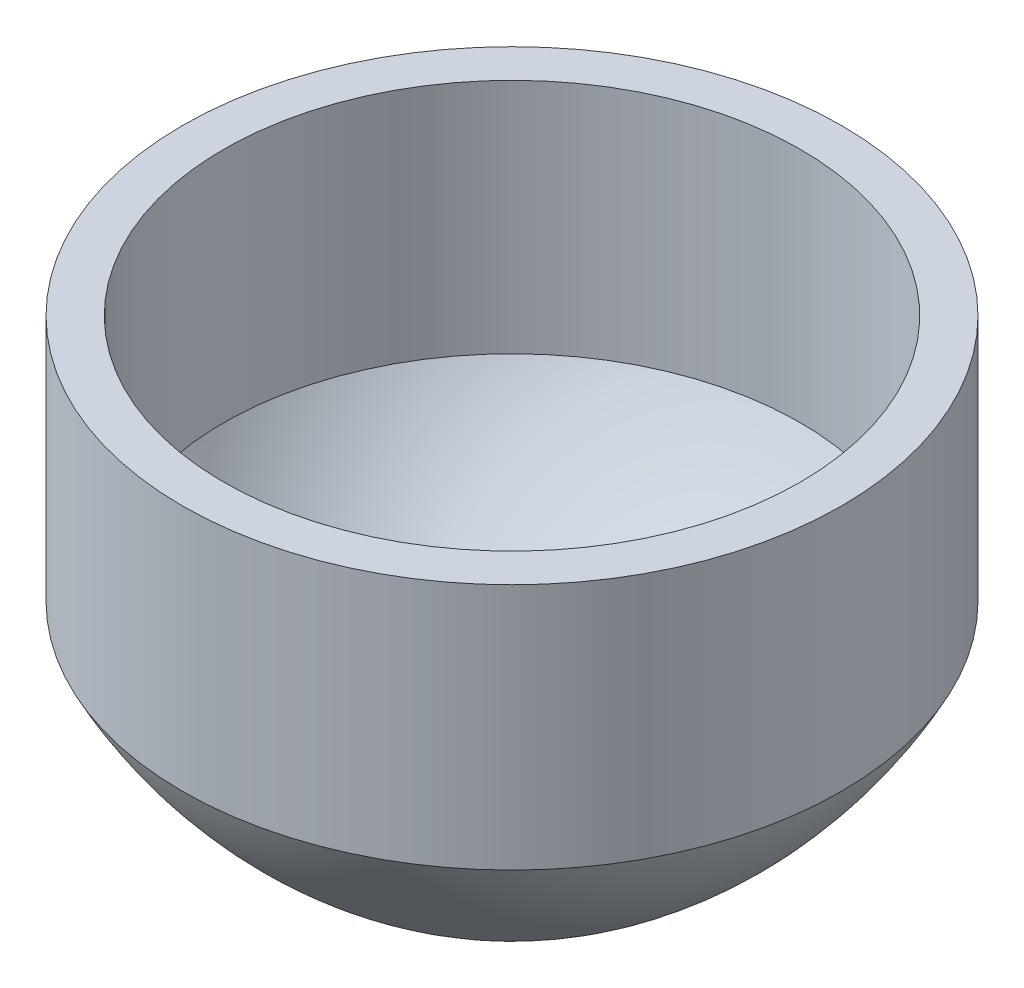
ISO-10303-21;
HEADER;
FILE_DESCRIPTION(('STEP AP214'),'2;1');
FILE_NAME('part.step','',(''),(''),'','','');
FILE_SCHEMA(('AUTOMOTIVE_DESIGN { 1 0 10303 214 1 1 1 1 }'));
ENDSEC;
DATA;
#1=APPLICATION_CONTEXT('core data for automotive mechanical design processes');
#2=APPLICATION_PROTOCOL_DEFINITION('international standard','automotive_design',2000,#1);
#3=PRODUCT_CONTEXT('',#1,'mechanical');
#4=PRODUCT('Part','Part','',(#3));
#5=PRODUCT_RELATED_PRODUCT_CATEGORY('part','',(#4));
#6=PRODUCT_DEFINITION_FORMATION('','',#4);
#7=PRODUCT_DEFINITION_CONTEXT('part definition',#1,'design');
#8=PRODUCT_DEFINITION('design','',#6,#7);
#9=PRODUCT_DEFINITION_SHAPE('','',#8);
#10=(LENGTH_UNIT() NAMED_UNIT(*) SI_UNIT(.MILLI.,.METRE.));
#11=(NAMED_UNIT(*) PLANE_ANGLE_UNIT() SI_UNIT($,.RADIAN.));
#12=(NAMED_UNIT(*) SI_UNIT($,.STERADIAN.) SOLID_ANGLE_UNIT());
#13=UNCERTAINTY_MEASURE_WITH_UNIT(LENGTH_MEASURE(1.E-05),#10,'distance_accuracy_value','');
#14=(GEOMETRIC_REPRESENTATION_CONTEXT(3) GLOBAL_UNCERTAINTY_ASSIGNED_CONTEXT((#13)) GLOBAL_UNIT_ASSIGNED_CONTEXT((#10,
#11,#12)) REPRESENTATION_CONTEXT('',''));
#15=CARTESIAN_POINT('',(0.,0.,0.));
#16=DIRECTION('',(0.,0.,1.));
#17=DIRECTION('',(1.,0.,0.));
#18=AXIS2_PLACEMENT_3D('',#15,#16,#17);
#19=CARTESIAN_POINT('',(3.49148133884313E-12,-1000.,0.));
#20=DIRECTION('',(0.,-1.,0.));
#21=DIRECTION('',(1.,0.,0.));
#22=AXIS2_PLACEMENT_3D('',#19,#20,#21);
#23=CYLINDRICAL_SURFACE('',#22,1600.);
#24=CARTESIAN_POINT('',(0.,-5.55111512312578E-12,0.));
#25=DIRECTION('',(0.,-1.,0.));
#26=DIRECTION('',(1.,0.,0.));
#27=AXIS2_PLACEMENT_3D('',#24,#25,#26);
#28=CIRCLE('',#27,1600.);
#29=CARTESIAN_POINT('',(1600.,0.,0.));
#30=VERTEX_POINT('',#29);
#31=EDGE_CURVE('E56',#30,#30,#28,.T.);
#32=ORIENTED_EDGE('',*,*,#31,.T.);
#33=EDGE_LOOP('',(#32));
#34=FACE_BOUND('',#33,.T.);
#35=CARTESIAN_POINT('',(4.18977760661178E-12,-1200.00000000001,0.));
#36=DIRECTION('',(0.,-1.,0.));
#37=DIRECTION('',(1.,0.,0.));
#38=AXIS2_PLACEMENT_3D('',#35,#36,#37);
#39=CIRCLE('',#38,1600.);
#40=CARTESIAN_POINT('',(1600.,-1200.,0.));
#41=VERTEX_POINT('',#40);
#42=EDGE_CURVE('E11',#41,#41,#39,.T.);
#43=ORIENTED_EDGE('',*,*,#42,.F.);
#44=EDGE_LOOP('',(#43));
#45=FACE_BOUND('',#44,.T.);
#46=ADVANCED_FACE('F32',(#34,#45),#23,.T.);
#47=CARTESIAN_POINT('',(-352.065600855902,-185.386827428753,0.));
#48=DIRECTION('',(0.,0.,-1.));
#49=DIRECTION('',(1.,0.,0.));
#50=AXIS2_PLACEMENT_3D('',#47,#48,#49);
#51=CIRCLE('',#50,2200.);
#52=TRIMMED_CURVE('',#51,(PARAMETER_VALUE(-1.41007546603232)),
(PARAMETER_VALUE(1.41007546603232)),.T.,.PARAMETER.);
#53=CARTESIAN_POINT('',(6.66133814775094E-13,-185.386827428752,0.));
#54=DIRECTION('',(0.,-1.,0.));
#55=AXIS1_PLACEMENT('',#53,#54);
#56=SURFACE_OF_REVOLUTION('',#52,#55);
#57=ORIENTED_EDGE('',*,*,#42,.T.);
#58=EDGE_LOOP('',(#57));
#59=FACE_BOUND('',#58,.T.);
#60=CARTESIAN_POINT('',(0.,-2357.03362483711,0.));
#61=VERTEX_POINT('',#60);
#62=VERTEX_LOOP('',#61);
#63=FACE_BOUND('',#62,.T.);
#64=ADVANCED_FACE('F49',(#59,#63),#56,.T.);
#65=CARTESIAN_POINT('',(-352.065600855902,-185.386827428753,0.));
#66=DIRECTION('',(0.,0.,-1.));
#67=DIRECTION('',(1.,0.,0.));
#68=AXIS2_PLACEMENT_3D('',#65,#66,#67);
#69=CIRCLE('',#68,2000.);
#70=TRIMMED_CURVE('',#69,(PARAMETER_VALUE(-1.39384147267305)),
(PARAMETER_VALUE(1.39384147267305)),.T.,.PARAMETER.);
#71=CARTESIAN_POINT('',(6.66133814775094E-13,-185.386827428752,0.));
#72=DIRECTION('',(0.,-1.,0.));
#73=AXIS1_PLACEMENT('',#71,#72);
#74=SURFACE_OF_REVOLUTION('',#70,#73);
#75=CARTESIAN_POINT('',(2.16493489801906E-12,-2154.15543056473,0.));
#76=VERTEX_POINT('',#75);
#77=VERTEX_LOOP('',#76);
#78=FACE_BOUND('',#77,.T.);
#79=CARTESIAN_POINT('',(4.0148190430442E-12,-1149.88987578965,0.));
#80=DIRECTION('',(0.,-1.,0.));
#81=DIRECTION('',(1.,0.,0.));
#82=AXIS2_PLACEMENT_3D('',#79,#80,#81);
#83=CIRCLE('',#82,1400.);
#84=CARTESIAN_POINT('',(1400.,-1149.88987578964,0.));
#85=VERTEX_POINT('',#84);
#86=EDGE_CURVE('E39',#85,#85,#83,.T.);
#87=ORIENTED_EDGE('',*,*,#86,.F.);
#88=EDGE_LOOP('',(#87));
#89=FACE_BOUND('',#88,.T.);
#90=ADVANCED_FACE('F45',(#78,#89),#74,.F.);
#91=CARTESIAN_POINT('',(3.49148133884313E-12,-1000.,0.));
#92=DIRECTION('',(0.,-1.,0.));
#93=DIRECTION('',(1.,0.,0.));
#94=AXIS2_PLACEMENT_3D('',#91,#92,#93);
#95=CYLINDRICAL_SURFACE('',#94,1400.);
#96=ORIENTED_EDGE('',*,*,#86,.T.);
#97=EDGE_LOOP('',(#96));
#98=FACE_BOUND('',#97,.T.);
#99=CARTESIAN_POINT('',(0.,-4.88498130835069E-12,0.));
#100=DIRECTION('',(0.,-1.,0.));
#101=DIRECTION('',(1.,0.,0.));
#102=AXIS2_PLACEMENT_3D('',#99,#100,#101);
#103=CIRCLE('',#102,1400.);
#104=CARTESIAN_POINT('',(1400.,0.,0.));
#105=VERTEX_POINT('',#104);
#106=EDGE_CURVE('E54',#105,#105,#103,.T.);
#107=ORIENTED_EDGE('',*,*,#106,.F.);
#108=EDGE_LOOP('',(#107));
#109=FACE_BOUND('',#108,.T.);
#110=ADVANCED_FACE('F48',(#98,#109),#95,.F.);
#111=CARTESIAN_POINT('',(1400.,-3.49148133884313E-13,0.));
#112=DIRECTION('',(0.,1.,0.));
#113=DIRECTION('',(-1.,0.,0.));
#114=AXIS2_PLACEMENT_3D('',#111,#112,#113);
#115=PLANE('',#114);
#116=ORIENTED_EDGE('',*,*,#106,.T.);
#117=EDGE_LOOP('',(#116));
#118=FACE_BOUND('',#117,.T.);
#119=ORIENTED_EDGE('',*,*,#31,.F.);
#120=EDGE_LOOP('',(#119));
#121=FACE_BOUND('',#120,.T.);
#122=ADVANCED_FACE('F64',(#118,#121),#115,.T.);
#123=CLOSED_SHELL('',(#46,#64,#90,#110,#122));
#124=MANIFOLD_SOLID_BREP('B2',#123);
#125=ADVANCED_BREP_SHAPE_REPRESENTATION('',(#18,#124),#14);
#126=SHAPE_DEFINITION_REPRESENTATION(#9,#125);
ENDSEC;
END-ISO-10303-21;
